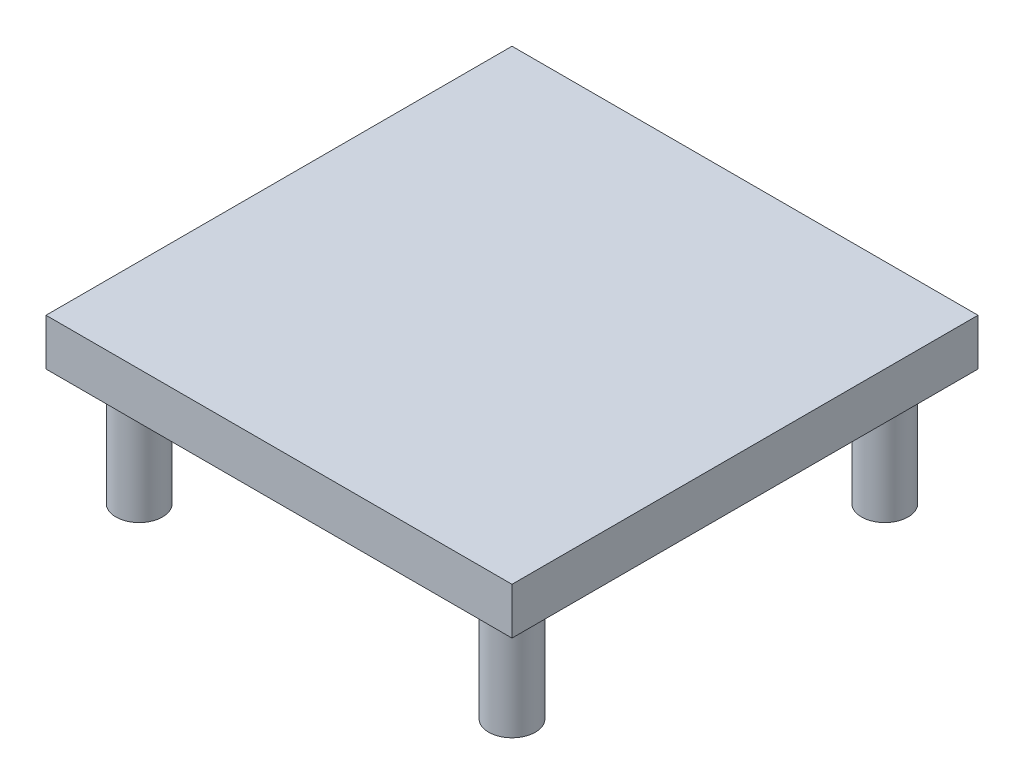
ISO-10303-21;
HEADER;
FILE_DESCRIPTION(('STEP AP214'),'2;1');
FILE_NAME('part.step','',(''),(''),'','','');
FILE_SCHEMA(('AUTOMOTIVE_DESIGN { 1 0 10303 214 1 1 1 1 }'));
ENDSEC;
DATA;
#1=APPLICATION_CONTEXT('core data for automotive mechanical design processes');
#2=APPLICATION_PROTOCOL_DEFINITION('international standard','automotive_design',2000,#1);
#3=PRODUCT_CONTEXT('',#1,'mechanical');
#4=PRODUCT('Part','Part','',(#3));
#5=PRODUCT_RELATED_PRODUCT_CATEGORY('part','',(#4));
#6=PRODUCT_DEFINITION_FORMATION('','',#4);
#7=PRODUCT_DEFINITION_CONTEXT('part definition',#1,'design');
#8=PRODUCT_DEFINITION('design','',#6,#7);
#9=PRODUCT_DEFINITION_SHAPE('','',#8);
#10=(LENGTH_UNIT() NAMED_UNIT(*) SI_UNIT(.MILLI.,.METRE.));
#11=(NAMED_UNIT(*) PLANE_ANGLE_UNIT() SI_UNIT($,.RADIAN.));
#12=(NAMED_UNIT(*) SI_UNIT($,.STERADIAN.) SOLID_ANGLE_UNIT());
#13=UNCERTAINTY_MEASURE_WITH_UNIT(LENGTH_MEASURE(1.E-05),#10,'distance_accuracy_value','');
#14=(GEOMETRIC_REPRESENTATION_CONTEXT(3) GLOBAL_UNCERTAINTY_ASSIGNED_CONTEXT((#13)) GLOBAL_UNIT_ASSIGNED_CONTEXT((#10,
#11,#12)) REPRESENTATION_CONTEXT('',''));
#15=CARTESIAN_POINT('',(0.,0.,0.));
#16=DIRECTION('',(0.,0.,1.));
#17=DIRECTION('',(1.,0.,0.));
#18=AXIS2_PLACEMENT_3D('',#15,#16,#17);
#19=CARTESIAN_POINT('',(100.,20.,100.));
#20=DIRECTION('',(-1.,0.,0.));
#21=DIRECTION('',(0.,0.,1.));
#22=AXIS2_PLACEMENT_3D('',#19,#20,#21);
#23=PLANE('',#22);
#24=DIRECTION('',(0.,0.,-1.));
#25=VECTOR('',#24,1.);
#26=CARTESIAN_POINT('',(100.,0.,100.));
#27=LINE('',#26,#25);
#28=CARTESIAN_POINT('',(100.,0.,100.));
#29=VERTEX_POINT('',#28);
#30=CARTESIAN_POINT('',(100.,0.,-100.));
#31=VERTEX_POINT('',#30);
#32=EDGE_CURVE('E104',#29,#31,#27,.T.);
#33=ORIENTED_EDGE('',*,*,#32,.T.);
#34=DIRECTION('',(0.,-1.,0.));
#35=VECTOR('',#34,1.);
#36=CARTESIAN_POINT('',(100.,20.,-100.));
#37=LINE('',#36,#35);
#38=CARTESIAN_POINT('',(100.,20.,-100.));
#39=VERTEX_POINT('',#38);
#40=EDGE_CURVE('E95',#39,#31,#37,.T.);
#41=ORIENTED_EDGE('',*,*,#40,.F.);
#42=DIRECTION('',(0.,0.,-1.));
#43=VECTOR('',#42,1.);
#44=CARTESIAN_POINT('',(100.,20.,100.));
#45=LINE('',#44,#43);
#46=CARTESIAN_POINT('',(100.,20.,100.));
#47=VERTEX_POINT('',#46);
#48=EDGE_CURVE('E89',#47,#39,#45,.T.);
#49=ORIENTED_EDGE('',*,*,#48,.F.);
#50=DIRECTION('',(0.,-1.,0.));
#51=VECTOR('',#50,1.);
#52=CARTESIAN_POINT('',(100.,20.,100.));
#53=LINE('',#52,#51);
#54=EDGE_CURVE('E100',#47,#29,#53,.T.);
#55=ORIENTED_EDGE('',*,*,#54,.T.);
#56=EDGE_LOOP('',(#33,#41,#49,#55));
#57=FACE_BOUND('',#56,.T.);
#58=ADVANCED_FACE('F37',(#57),#23,.F.);
#59=CARTESIAN_POINT('',(100.,20.,-100.));
#60=DIRECTION('',(0.,0.,1.));
#61=DIRECTION('',(1.,0.,0.));
#62=AXIS2_PLACEMENT_3D('',#59,#60,#61);
#63=PLANE('',#62);
#64=DIRECTION('',(-1.,0.,0.));
#65=VECTOR('',#64,1.);
#66=CARTESIAN_POINT('',(100.,0.,-100.));
#67=LINE('',#66,#65);
#68=CARTESIAN_POINT('',(-100.,0.,-100.));
#69=VERTEX_POINT('',#68);
#70=EDGE_CURVE('E94',#31,#69,#67,.T.);
#71=ORIENTED_EDGE('',*,*,#70,.T.);
#72=DIRECTION('',(0.,-1.,0.));
#73=VECTOR('',#72,1.);
#74=CARTESIAN_POINT('',(-100.,20.,-100.));
#75=LINE('',#74,#73);
#76=CARTESIAN_POINT('',(-100.,20.,-100.));
#77=VERTEX_POINT('',#76);
#78=EDGE_CURVE('E92',#77,#69,#75,.T.);
#79=ORIENTED_EDGE('',*,*,#78,.F.);
#80=DIRECTION('',(-1.,0.,0.));
#81=VECTOR('',#80,1.);
#82=CARTESIAN_POINT('',(100.,20.,-100.));
#83=LINE('',#82,#81);
#84=EDGE_CURVE('E84',#39,#77,#83,.T.);
#85=ORIENTED_EDGE('',*,*,#84,.F.);
#86=ORIENTED_EDGE('',*,*,#40,.T.);
#87=EDGE_LOOP('',(#71,#79,#85,#86));
#88=FACE_BOUND('',#87,.T.);
#89=ADVANCED_FACE('F93',(#88),#63,.F.);
#90=CARTESIAN_POINT('',(-100.,20.,-100.));
#91=DIRECTION('',(1.,0.,0.));
#92=DIRECTION('',(0.,0.,-1.));
#93=AXIS2_PLACEMENT_3D('',#90,#91,#92);
#94=PLANE('',#93);
#95=DIRECTION('',(0.,0.,1.));
#96=VECTOR('',#95,1.);
#97=CARTESIAN_POINT('',(-100.,0.,-100.));
#98=LINE('',#97,#96);
#99=CARTESIAN_POINT('',(-100.,0.,100.));
#100=VERTEX_POINT('',#99);
#101=EDGE_CURVE('E70',#69,#100,#98,.T.);
#102=ORIENTED_EDGE('',*,*,#101,.T.);
#103=DIRECTION('',(0.,-1.,0.));
#104=VECTOR('',#103,1.);
#105=CARTESIAN_POINT('',(-100.,20.,100.));
#106=LINE('',#105,#104);
#107=CARTESIAN_POINT('',(-100.,20.,100.));
#108=VERTEX_POINT('',#107);
#109=EDGE_CURVE('E96',#108,#100,#106,.T.);
#110=ORIENTED_EDGE('',*,*,#109,.F.);
#111=DIRECTION('',(0.,0.,1.));
#112=VECTOR('',#111,1.);
#113=CARTESIAN_POINT('',(-100.,20.,-100.));
#114=LINE('',#113,#112);
#115=EDGE_CURVE('E87',#77,#108,#114,.T.);
#116=ORIENTED_EDGE('',*,*,#115,.F.);
#117=ORIENTED_EDGE('',*,*,#78,.T.);
#118=EDGE_LOOP('',(#102,#110,#116,#117));
#119=FACE_BOUND('',#118,.T.);
#120=ADVANCED_FACE('F98',(#119),#94,.F.);
#121=CARTESIAN_POINT('',(-100.,20.,100.));
#122=DIRECTION('',(0.,0.,-1.));
#123=DIRECTION('',(-1.,0.,0.));
#124=AXIS2_PLACEMENT_3D('',#121,#122,#123);
#125=PLANE('',#124);
#126=DIRECTION('',(1.,0.,0.));
#127=VECTOR('',#126,1.);
#128=CARTESIAN_POINT('',(-100.,0.,100.));
#129=LINE('',#128,#127);
#130=EDGE_CURVE('E76',#100,#29,#129,.T.);
#131=ORIENTED_EDGE('',*,*,#130,.T.);
#132=ORIENTED_EDGE('',*,*,#54,.F.);
#133=DIRECTION('',(1.,0.,0.));
#134=VECTOR('',#133,1.);
#135=CARTESIAN_POINT('',(-100.,20.,100.));
#136=LINE('',#135,#134);
#137=EDGE_CURVE('E53',#108,#47,#136,.T.);
#138=ORIENTED_EDGE('',*,*,#137,.F.);
#139=ORIENTED_EDGE('',*,*,#109,.T.);
#140=EDGE_LOOP('',(#131,#132,#138,#139));
#141=FACE_BOUND('',#140,.T.);
#142=ADVANCED_FACE('F136',(#141),#125,.F.);
#143=CARTESIAN_POINT('',(0.,20.,0.));
#144=DIRECTION('',(0.,1.,0.));
#145=DIRECTION('',(0.,0.,1.));
#146=AXIS2_PLACEMENT_3D('',#143,#144,#145);
#147=PLANE('',#146);
#148=ORIENTED_EDGE('',*,*,#48,.T.);
#149=ORIENTED_EDGE('',*,*,#84,.T.);
#150=ORIENTED_EDGE('',*,*,#115,.T.);
#151=ORIENTED_EDGE('',*,*,#137,.T.);
#152=EDGE_LOOP('',(#148,#149,#150,#151));
#153=FACE_BOUND('',#152,.T.);
#154=ADVANCED_FACE('F85',(#153),#147,.T.);
#155=CARTESIAN_POINT('',(0.,0.,0.));
#156=DIRECTION('',(0.,1.,0.));
#157=DIRECTION('',(0.,0.,1.));
#158=AXIS2_PLACEMENT_3D('',#155,#156,#157);
#159=PLANE('',#158);
#160=CARTESIAN_POINT('',(-80.,0.,79.9999999999956));
#161=DIRECTION('',(0.,1.,0.));
#162=DIRECTION('',(0.,0.,1.));
#163=AXIS2_PLACEMENT_3D('',#160,#161,#162);
#164=CIRCLE('',#163,10.0000000000048);
#165=CARTESIAN_POINT('',(-80.,0.,90.0000000000004));
#166=VERTEX_POINT('',#165);
#167=EDGE_CURVE('E11',#166,#166,#164,.F.);
#168=ORIENTED_EDGE('',*,*,#167,.F.);
#169=EDGE_LOOP('',(#168));
#170=FACE_BOUND('',#169,.T.);
#171=CARTESIAN_POINT('',(-79.9999999999956,0.,-80.0000000000044));
#172=DIRECTION('',(0.,1.,0.));
#173=DIRECTION('',(0.,0.,1.));
#174=AXIS2_PLACEMENT_3D('',#171,#172,#173);
#175=CIRCLE('',#174,10.0000000000033);
#176=CARTESIAN_POINT('',(-79.9999999999956,0.,-70.0000000000012));
#177=VERTEX_POINT('',#176);
#178=EDGE_CURVE('E45',#177,#177,#175,.F.);
#179=ORIENTED_EDGE('',*,*,#178,.F.);
#180=EDGE_LOOP('',(#179));
#181=FACE_BOUND('',#180,.T.);
#182=CARTESIAN_POINT('',(80.0000000000044,0.,-80.));
#183=DIRECTION('',(0.,1.,0.));
#184=DIRECTION('',(0.,0.,1.));
#185=AXIS2_PLACEMENT_3D('',#182,#183,#184);
#186=CIRCLE('',#185,9.99999999999887);
#187=CARTESIAN_POINT('',(80.0000000000044,0.,-70.0000000000012));
#188=VERTEX_POINT('',#187);
#189=EDGE_CURVE('E117',#188,#188,#186,.F.);
#190=ORIENTED_EDGE('',*,*,#189,.F.);
#191=EDGE_LOOP('',(#190));
#192=FACE_BOUND('',#191,.T.);
#193=CARTESIAN_POINT('',(80.,0.,80.));
#194=DIRECTION('',(0.,1.,0.));
#195=DIRECTION('',(0.,0.,1.));
#196=AXIS2_PLACEMENT_3D('',#193,#194,#195);
#197=CIRCLE('',#196,9.99999999999999);
#198=CARTESIAN_POINT('',(80.,0.,90.));
#199=VERTEX_POINT('',#198);
#200=EDGE_CURVE('E114',#199,#199,#197,.F.);
#201=ORIENTED_EDGE('',*,*,#200,.F.);
#202=EDGE_LOOP('',(#201));
#203=FACE_BOUND('',#202,.T.);
#204=ORIENTED_EDGE('',*,*,#32,.F.);
#205=ORIENTED_EDGE('',*,*,#130,.F.);
#206=ORIENTED_EDGE('',*,*,#101,.F.);
#207=ORIENTED_EDGE('',*,*,#70,.F.);
#208=EDGE_LOOP('',(#204,#205,#206,#207));
#209=FACE_BOUND('',#208,.T.);
#210=ADVANCED_FACE('F124',(#170,#181,#192,#203,#209),#159,.F.);
#211=CARTESIAN_POINT('',(80.,-50.,80.));
#212=DIRECTION('',(0.,1.,0.));
#213=DIRECTION('',(0.,0.,1.));
#214=AXIS2_PLACEMENT_3D('',#211,#212,#213);
#215=CYLINDRICAL_SURFACE('',#214,9.99999999999999);
#216=CARTESIAN_POINT('',(80.,-50.,80.));
#217=DIRECTION('',(0.,-1.,0.));
#218=DIRECTION('',(0.,0.,-1.));
#219=AXIS2_PLACEMENT_3D('',#216,#217,#218);
#220=CIRCLE('',#219,9.99999999999999);
#221=CARTESIAN_POINT('',(80.,-50.,70.));
#222=VERTEX_POINT('',#221);
#223=EDGE_CURVE('E107',#222,#222,#220,.T.);
#224=ORIENTED_EDGE('',*,*,#223,.F.);
#225=EDGE_LOOP('',(#224));
#226=FACE_BOUND('',#225,.T.);
#227=ORIENTED_EDGE('',*,*,#200,.T.);
#228=EDGE_LOOP('',(#227));
#229=FACE_BOUND('',#228,.T.);
#230=ADVANCED_FACE('F127',(#226,#229),#215,.T.);
#231=CARTESIAN_POINT('',(80.,-50.,80.));
#232=DIRECTION('',(0.,-1.,0.));
#233=DIRECTION('',(0.,0.,-1.));
#234=AXIS2_PLACEMENT_3D('',#231,#232,#233);
#235=PLANE('',#234);
#236=ORIENTED_EDGE('',*,*,#223,.T.);
#237=EDGE_LOOP('',(#236));
#238=FACE_BOUND('',#237,.T.);
#239=ADVANCED_FACE('F180',(#238),#235,.T.);
#240=CARTESIAN_POINT('',(80.0000000000044,-50.,-80.));
#241=DIRECTION('',(0.,1.,0.));
#242=DIRECTION('',(0.,0.,1.));
#243=AXIS2_PLACEMENT_3D('',#240,#241,#242);
#244=CYLINDRICAL_SURFACE('',#243,9.99999999999887);
#245=CARTESIAN_POINT('',(80.0000000000044,-50.,-80.));
#246=DIRECTION('',(0.,-1.,0.));
#247=DIRECTION('',(0.,0.,-1.));
#248=AXIS2_PLACEMENT_3D('',#245,#246,#247);
#249=CIRCLE('',#248,9.99999999999887);
#250=CARTESIAN_POINT('',(80.0000000000044,-50.,-89.9999999999989));
#251=VERTEX_POINT('',#250);
#252=EDGE_CURVE('E259',#251,#251,#249,.T.);
#253=ORIENTED_EDGE('',*,*,#252,.F.);
#254=EDGE_LOOP('',(#253));
#255=FACE_BOUND('',#254,.T.);
#256=ORIENTED_EDGE('',*,*,#189,.T.);
#257=EDGE_LOOP('',(#256));
#258=FACE_BOUND('',#257,.T.);
#259=ADVANCED_FACE('F190',(#255,#258),#244,.T.);
#260=CARTESIAN_POINT('',(80.0000000000044,-50.,-80.));
#261=DIRECTION('',(0.,-1.,0.));
#262=DIRECTION('',(0.,0.,-1.));
#263=AXIS2_PLACEMENT_3D('',#260,#261,#262);
#264=PLANE('',#263);
#265=ORIENTED_EDGE('',*,*,#252,.T.);
#266=EDGE_LOOP('',(#265));
#267=FACE_BOUND('',#266,.T.);
#268=ADVANCED_FACE('F200',(#267),#264,.T.);
#269=CARTESIAN_POINT('',(-79.9999999999956,-50.,-80.0000000000044));
#270=DIRECTION('',(0.,1.,0.));
#271=DIRECTION('',(0.,0.,1.));
#272=AXIS2_PLACEMENT_3D('',#269,#270,#271);
#273=CYLINDRICAL_SURFACE('',#272,10.0000000000033);
#274=CARTESIAN_POINT('',(-79.9999999999956,-50.,-80.0000000000044));
#275=DIRECTION('',(0.,-1.,0.));
#276=DIRECTION('',(0.,0.,-1.));
#277=AXIS2_PLACEMENT_3D('',#274,#275,#276);
#278=CIRCLE('',#277,10.0000000000033);
#279=CARTESIAN_POINT('',(-79.9999999999956,-50.,-90.0000000000077));
#280=VERTEX_POINT('',#279);
#281=EDGE_CURVE('E256',#280,#280,#278,.T.);
#282=ORIENTED_EDGE('',*,*,#281,.F.);
#283=EDGE_LOOP('',(#282));
#284=FACE_BOUND('',#283,.T.);
#285=ORIENTED_EDGE('',*,*,#178,.T.);
#286=EDGE_LOOP('',(#285));
#287=FACE_BOUND('',#286,.T.);
#288=ADVANCED_FACE('F122',(#284,#287),#273,.T.);
#289=CARTESIAN_POINT('',(-79.9999999999956,-50.,-80.0000000000044));
#290=DIRECTION('',(0.,-1.,0.));
#291=DIRECTION('',(0.,0.,-1.));
#292=AXIS2_PLACEMENT_3D('',#289,#290,#291);
#293=PLANE('',#292);
#294=ORIENTED_EDGE('',*,*,#281,.T.);
#295=EDGE_LOOP('',(#294));
#296=FACE_BOUND('',#295,.T.);
#297=ADVANCED_FACE('F219',(#296),#293,.T.);
#298=CARTESIAN_POINT('',(-80.,-50.,79.9999999999956));
#299=DIRECTION('',(0.,1.,0.));
#300=DIRECTION('',(0.,0.,1.));
#301=AXIS2_PLACEMENT_3D('',#298,#299,#300);
#302=CYLINDRICAL_SURFACE('',#301,10.0000000000048);
#303=CARTESIAN_POINT('',(-80.,-50.,79.9999999999956));
#304=DIRECTION('',(0.,-1.,0.));
#305=DIRECTION('',(0.,0.,-1.));
#306=AXIS2_PLACEMENT_3D('',#303,#304,#305);
#307=CIRCLE('',#306,10.0000000000048);
#308=CARTESIAN_POINT('',(-80.,-50.,69.9999999999908));
#309=VERTEX_POINT('',#308);
#310=EDGE_CURVE('E255',#309,#309,#307,.T.);
#311=ORIENTED_EDGE('',*,*,#310,.F.);
#312=EDGE_LOOP('',(#311));
#313=FACE_BOUND('',#312,.T.);
#314=ORIENTED_EDGE('',*,*,#167,.T.);
#315=EDGE_LOOP('',(#314));
#316=FACE_BOUND('',#315,.T.);
#317=ADVANCED_FACE('F229',(#313,#316),#302,.T.);
#318=CARTESIAN_POINT('',(-80.,-50.,79.9999999999956));
#319=DIRECTION('',(0.,-1.,0.));
#320=DIRECTION('',(0.,0.,-1.));
#321=AXIS2_PLACEMENT_3D('',#318,#319,#320);
#322=PLANE('',#321);
#323=ORIENTED_EDGE('',*,*,#310,.T.);
#324=EDGE_LOOP('',(#323));
#325=FACE_BOUND('',#324,.T.);
#326=ADVANCED_FACE('F239',(#325),#322,.T.);
#327=CLOSED_SHELL('',(#58,#89,#120,#142,#154,#210,#230,#239,#259,#268,#288,#297,#317,#326));
#328=MANIFOLD_SOLID_BREP('B2',#327);
#329=ADVANCED_BREP_SHAPE_REPRESENTATION('',(#18,#328),#14);
#330=SHAPE_DEFINITION_REPRESENTATION(#9,#329);
ENDSEC;
END-ISO-10303-21;
